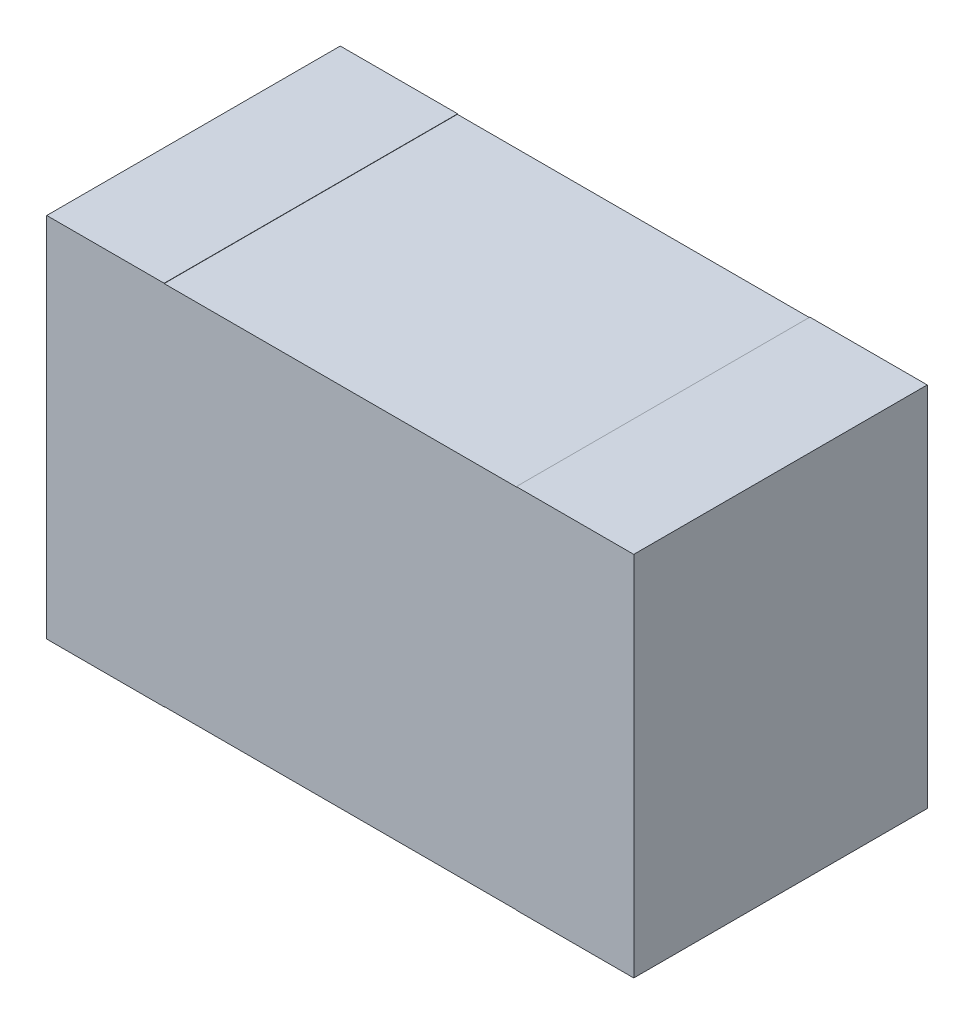
ISO-10303-21;
HEADER;
FILE_DESCRIPTION(('STEP AP214'),'2;1');
FILE_NAME('part.step','',(''),(''),'','','');
FILE_SCHEMA(('AUTOMOTIVE_DESIGN { 1 0 10303 214 1 1 1 1 }'));
ENDSEC;
DATA;
#1=APPLICATION_CONTEXT('core data for automotive mechanical design processes');
#2=APPLICATION_PROTOCOL_DEFINITION('international standard','automotive_design',2000,#1);
#3=PRODUCT_CONTEXT('',#1,'mechanical');
#4=PRODUCT('Part','Part','',(#3));
#5=PRODUCT_RELATED_PRODUCT_CATEGORY('part','',(#4));
#6=PRODUCT_DEFINITION_FORMATION('','',#4);
#7=PRODUCT_DEFINITION_CONTEXT('part definition',#1,'design');
#8=PRODUCT_DEFINITION('design','',#6,#7);
#9=PRODUCT_DEFINITION_SHAPE('','',#8);
#10=(LENGTH_UNIT() NAMED_UNIT(*) SI_UNIT(.MILLI.,.METRE.));
#11=(NAMED_UNIT(*) PLANE_ANGLE_UNIT() SI_UNIT($,.RADIAN.));
#12=(NAMED_UNIT(*) SI_UNIT($,.STERADIAN.) SOLID_ANGLE_UNIT());
#13=UNCERTAINTY_MEASURE_WITH_UNIT(LENGTH_MEASURE(1.E-05),#10,'distance_accuracy_value','');
#14=(GEOMETRIC_REPRESENTATION_CONTEXT(3) GLOBAL_UNCERTAINTY_ASSIGNED_CONTEXT((#13)) GLOBAL_UNIT_ASSIGNED_CONTEXT((#10,
#11,#12)) REPRESENTATION_CONTEXT('',''));
#15=CARTESIAN_POINT('',(0.,0.,0.));
#16=DIRECTION('',(0.,0.,1.));
#17=DIRECTION('',(1.,0.,0.));
#18=AXIS2_PLACEMENT_3D('',#15,#16,#17);
#19=CARTESIAN_POINT('',(0.6,-0.625,-0.999));
#20=DIRECTION('',(0.,0.,1.));
#21=DIRECTION('',(0.,-1.,0.));
#22=AXIS2_PLACEMENT_3D('',#19,#20,#21);
#23=PLANE('',#22);
#24=DIRECTION('',(0.,1.,0.));
#25=VECTOR('',#24,1.);
#26=CARTESIAN_POINT('',(0.6,-0.625,-0.999));
#27=LINE('',#26,#25);
#28=CARTESIAN_POINT('',(0.6,-0.624,-0.999));
#29=VERTEX_POINT('',#28);
#30=CARTESIAN_POINT('',(0.6,0.624,-0.999));
#31=VERTEX_POINT('',#30);
#32=EDGE_CURVE('E187',#29,#31,#27,.T.);
#33=ORIENTED_EDGE('',*,*,#32,.F.);
#34=DIRECTION('',(-1.,0.,0.));
#35=VECTOR('',#34,1.);
#36=CARTESIAN_POINT('',(0.6,-0.624,-0.999));
#37=LINE('',#36,#35);
#38=CARTESIAN_POINT('',(-0.6,-0.624,-0.999));
#39=VERTEX_POINT('',#38);
#40=EDGE_CURVE('E11',#29,#39,#37,.T.);
#41=ORIENTED_EDGE('',*,*,#40,.T.);
#42=DIRECTION('',(0.,1.,0.));
#43=VECTOR('',#42,1.);
#44=CARTESIAN_POINT('',(-0.6,-0.625,-0.999));
#45=LINE('',#44,#43);
#46=CARTESIAN_POINT('',(-0.6,0.624,-0.999));
#47=VERTEX_POINT('',#46);
#48=EDGE_CURVE('E176',#39,#47,#45,.T.);
#49=ORIENTED_EDGE('',*,*,#48,.T.);
#50=DIRECTION('',(-1.,0.,0.));
#51=VECTOR('',#50,1.);
#52=CARTESIAN_POINT('',(0.6,0.624,-0.999));
#53=LINE('',#52,#51);
#54=EDGE_CURVE('E188',#31,#47,#53,.T.);
#55=ORIENTED_EDGE('',*,*,#54,.F.);
#56=EDGE_LOOP('',(#33,#41,#49,#55));
#57=FACE_BOUND('',#56,.T.);
#58=ADVANCED_FACE('F47',(#57),#23,.F.);
#59=CARTESIAN_POINT('',(0.6,-0.624,-1.));
#60=DIRECTION('',(0.,1.,0.));
#61=DIRECTION('',(1.,0.,0.));
#62=AXIS2_PLACEMENT_3D('',#59,#60,#61);
#63=PLANE('',#62);
#64=DIRECTION('',(0.,0.,1.));
#65=VECTOR('',#64,1.);
#66=CARTESIAN_POINT('',(0.6,-0.624,-1.));
#67=LINE('',#66,#65);
#68=CARTESIAN_POINT('',(0.6,-0.624,0.));
#69=VERTEX_POINT('',#68);
#70=EDGE_CURVE('E58',#29,#69,#67,.T.);
#71=ORIENTED_EDGE('',*,*,#70,.T.);
#72=DIRECTION('',(1.,0.,0.));
#73=VECTOR('',#72,1.);
#74=CARTESIAN_POINT('',(0.6,-0.624,0.));
#75=LINE('',#74,#73);
#76=CARTESIAN_POINT('',(-0.6,-0.624,0.));
#77=VERTEX_POINT('',#76);
#78=EDGE_CURVE('E172',#77,#69,#75,.T.);
#79=ORIENTED_EDGE('',*,*,#78,.F.);
#80=DIRECTION('',(0.,0.,1.));
#81=VECTOR('',#80,1.);
#82=CARTESIAN_POINT('',(-0.6,-0.624,-1.));
#83=LINE('',#82,#81);
#84=EDGE_CURVE('E167',#39,#77,#83,.T.);
#85=ORIENTED_EDGE('',*,*,#84,.F.);
#86=ORIENTED_EDGE('',*,*,#40,.F.);
#87=EDGE_LOOP('',(#71,#79,#85,#86));
#88=FACE_BOUND('',#87,.T.);
#89=ADVANCED_FACE('F169',(#88),#63,.F.);
#90=CARTESIAN_POINT('',(0.6,0.625,-1.));
#91=DIRECTION('',(1.,0.,0.));
#92=DIRECTION('',(0.,1.,0.));
#93=AXIS2_PLACEMENT_3D('',#90,#91,#92);
#94=PLANE('',#93);
#95=DIRECTION('',(0.,-1.,0.));
#96=VECTOR('',#95,1.);
#97=CARTESIAN_POINT('',(0.6,0.625,0.));
#98=LINE('',#97,#96);
#99=CARTESIAN_POINT('',(0.6,0.625,0.));
#100=VERTEX_POINT('',#99);
#101=CARTESIAN_POINT('',(0.6,0.624,0.));
#102=VERTEX_POINT('',#101);
#103=EDGE_CURVE('E207',#100,#102,#98,.T.);
#104=ORIENTED_EDGE('',*,*,#103,.F.);
#105=DIRECTION('',(0.,0.,1.));
#106=VECTOR('',#105,1.);
#107=CARTESIAN_POINT('',(0.6,0.625,-1.));
#108=LINE('',#107,#106);
#109=CARTESIAN_POINT('',(0.6,0.625,-1.));
#110=VERTEX_POINT('',#109);
#111=EDGE_CURVE('E270',#110,#100,#108,.T.);
#112=ORIENTED_EDGE('',*,*,#111,.F.);
#113=DIRECTION('',(0.,-1.,0.));
#114=VECTOR('',#113,1.);
#115=CARTESIAN_POINT('',(0.6,0.625,-1.));
#116=LINE('',#115,#114);
#117=CARTESIAN_POINT('',(0.6,-0.625,-1.));
#118=VERTEX_POINT('',#117);
#119=EDGE_CURVE('E201',#110,#118,#116,.T.);
#120=ORIENTED_EDGE('',*,*,#119,.T.);
#121=DIRECTION('',(0.,0.,1.));
#122=VECTOR('',#121,1.);
#123=CARTESIAN_POINT('',(0.6,-0.625,-1.));
#124=LINE('',#123,#122);
#125=CARTESIAN_POINT('',(0.6,-0.625,0.));
#126=VERTEX_POINT('',#125);
#127=EDGE_CURVE('E226',#118,#126,#124,.T.);
#128=ORIENTED_EDGE('',*,*,#127,.T.);
#129=DIRECTION('',(2.168404344971E-13,-1.,0.));
#130=VECTOR('',#129,1.);
#131=CARTESIAN_POINT('',(0.6,-0.624,0.));
#132=LINE('',#131,#130);
#133=EDGE_CURVE('E177',#69,#126,#132,.T.);
#134=ORIENTED_EDGE('',*,*,#133,.F.);
#135=ORIENTED_EDGE('',*,*,#70,.F.);
#136=ORIENTED_EDGE('',*,*,#32,.T.);
#137=DIRECTION('',(0.,0.,1.));
#138=VECTOR('',#137,1.);
#139=CARTESIAN_POINT('',(0.6,0.624,-1.));
#140=LINE('',#139,#138);
#141=EDGE_CURVE('E190',#31,#102,#140,.T.);
#142=ORIENTED_EDGE('',*,*,#141,.T.);
#143=EDGE_LOOP('',(#104,#112,#120,#128,#134,#135,#136,#142));
#144=FACE_BOUND('',#143,.T.);
#145=ADVANCED_FACE('F318',(#144),#94,.F.);
#146=CARTESIAN_POINT('',(0.6,0.624,-1.));
#147=DIRECTION('',(0.,-1.,0.));
#148=DIRECTION('',(0.,0.,1.));
#149=AXIS2_PLACEMENT_3D('',#146,#147,#148);
#150=PLANE('',#149);
#151=DIRECTION('',(0.,0.,1.));
#152=VECTOR('',#151,1.);
#153=CARTESIAN_POINT('',(-0.6,0.624,-1.));
#154=LINE('',#153,#152);
#155=CARTESIAN_POINT('',(-0.6,0.624,0.));
#156=VERTEX_POINT('',#155);
#157=EDGE_CURVE('E181',#47,#156,#154,.T.);
#158=ORIENTED_EDGE('',*,*,#157,.T.);
#159=DIRECTION('',(-1.,0.,0.));
#160=VECTOR('',#159,1.);
#161=CARTESIAN_POINT('',(0.6,0.624,0.));
#162=LINE('',#161,#160);
#163=EDGE_CURVE('E159',#102,#156,#162,.T.);
#164=ORIENTED_EDGE('',*,*,#163,.F.);
#165=ORIENTED_EDGE('',*,*,#141,.F.);
#166=ORIENTED_EDGE('',*,*,#54,.T.);
#167=EDGE_LOOP('',(#158,#164,#165,#166));
#168=FACE_BOUND('',#167,.T.);
#169=ADVANCED_FACE('F316',(#168),#150,.F.);
#170=CARTESIAN_POINT('',(-0.6,0.625,-1.));
#171=DIRECTION('',(-1.,0.,0.));
#172=DIRECTION('',(0.,0.,-1.));
#173=AXIS2_PLACEMENT_3D('',#170,#171,#172);
#174=PLANE('',#173);
#175=DIRECTION('',(0.,1.,0.));
#176=VECTOR('',#175,1.);
#177=CARTESIAN_POINT('',(-0.6,0.625,0.));
#178=LINE('',#177,#176);
#179=CARTESIAN_POINT('',(-0.6,0.625,0.));
#180=VERTEX_POINT('',#179);
#181=EDGE_CURVE('E208',#156,#180,#178,.T.);
#182=ORIENTED_EDGE('',*,*,#181,.F.);
#183=ORIENTED_EDGE('',*,*,#157,.F.);
#184=ORIENTED_EDGE('',*,*,#48,.F.);
#185=ORIENTED_EDGE('',*,*,#84,.T.);
#186=DIRECTION('',(-2.168404344971E-13,1.,0.));
#187=VECTOR('',#186,1.);
#188=CARTESIAN_POINT('',(-0.6,-0.624,0.));
#189=LINE('',#188,#187);
#190=CARTESIAN_POINT('',(-0.6,-0.625,0.));
#191=VERTEX_POINT('',#190);
#192=EDGE_CURVE('E219',#191,#77,#189,.T.);
#193=ORIENTED_EDGE('',*,*,#192,.F.);
#194=DIRECTION('',(0.,0.,1.));
#195=VECTOR('',#194,1.);
#196=CARTESIAN_POINT('',(-0.6,-0.625,-1.));
#197=LINE('',#196,#195);
#198=CARTESIAN_POINT('',(-0.6,-0.625,-1.));
#199=VERTEX_POINT('',#198);
#200=EDGE_CURVE('E210',#199,#191,#197,.T.);
#201=ORIENTED_EDGE('',*,*,#200,.F.);
#202=DIRECTION('',(0.,1.,0.));
#203=VECTOR('',#202,1.);
#204=CARTESIAN_POINT('',(-0.6,0.625,-1.));
#205=LINE('',#204,#203);
#206=CARTESIAN_POINT('',(-0.6,0.625,-1.));
#207=VERTEX_POINT('',#206);
#208=EDGE_CURVE('E236',#199,#207,#205,.T.);
#209=ORIENTED_EDGE('',*,*,#208,.T.);
#210=DIRECTION('',(0.,0.,1.));
#211=VECTOR('',#210,1.);
#212=CARTESIAN_POINT('',(-0.6,0.625,-1.));
#213=LINE('',#212,#211);
#214=EDGE_CURVE('E257',#207,#180,#213,.T.);
#215=ORIENTED_EDGE('',*,*,#214,.T.);
#216=EDGE_LOOP('',(#182,#183,#184,#185,#193,#201,#209,#215));
#217=FACE_BOUND('',#216,.T.);
#218=ADVANCED_FACE('F180',(#217),#174,.F.);
#219=CARTESIAN_POINT('',(0.,0.,0.));
#220=DIRECTION('',(0.,0.,-1.));
#221=DIRECTION('',(1.,0.,0.));
#222=AXIS2_PLACEMENT_3D('',#219,#220,#221);
#223=PLANE('',#222);
#224=ORIENTED_EDGE('',*,*,#78,.T.);
#225=ORIENTED_EDGE('',*,*,#133,.T.);
#226=DIRECTION('',(1.,0.,0.));
#227=VECTOR('',#226,1.);
#228=CARTESIAN_POINT('',(-1.,-0.625,0.));
#229=LINE('',#228,#227);
#230=CARTESIAN_POINT('',(1.,-0.625,0.));
#231=VERTEX_POINT('',#230);
#232=EDGE_CURVE('E205',#126,#231,#229,.T.);
#233=ORIENTED_EDGE('',*,*,#232,.T.);
#234=DIRECTION('',(0.,1.,0.));
#235=VECTOR('',#234,1.);
#236=CARTESIAN_POINT('',(1.,0.625,0.));
#237=LINE('',#236,#235);
#238=CARTESIAN_POINT('',(1.,0.625,0.));
#239=VERTEX_POINT('',#238);
#240=EDGE_CURVE('E231',#231,#239,#237,.T.);
#241=ORIENTED_EDGE('',*,*,#240,.T.);
#242=DIRECTION('',(-1.,0.,0.));
#243=VECTOR('',#242,1.);
#244=CARTESIAN_POINT('',(-1.,0.625,0.));
#245=LINE('',#244,#243);
#246=EDGE_CURVE('E277',#239,#100,#245,.T.);
#247=ORIENTED_EDGE('',*,*,#246,.T.);
#248=ORIENTED_EDGE('',*,*,#103,.T.);
#249=ORIENTED_EDGE('',*,*,#163,.T.);
#250=ORIENTED_EDGE('',*,*,#181,.T.);
#251=DIRECTION('',(-1.,0.,0.));
#252=VECTOR('',#251,1.);
#253=CARTESIAN_POINT('',(-1.,0.625,0.));
#254=LINE('',#253,#252);
#255=CARTESIAN_POINT('',(-1.,0.625,0.));
#256=VERTEX_POINT('',#255);
#257=EDGE_CURVE('E200',#180,#256,#254,.T.);
#258=ORIENTED_EDGE('',*,*,#257,.T.);
#259=DIRECTION('',(0.,-1.,0.));
#260=VECTOR('',#259,1.);
#261=CARTESIAN_POINT('',(-1.,0.625,0.));
#262=LINE('',#261,#260);
#263=CARTESIAN_POINT('',(-1.,-0.625,0.));
#264=VERTEX_POINT('',#263);
#265=EDGE_CURVE('E227',#256,#264,#262,.T.);
#266=ORIENTED_EDGE('',*,*,#265,.T.);
#267=DIRECTION('',(1.,0.,0.));
#268=VECTOR('',#267,1.);
#269=CARTESIAN_POINT('',(-1.,-0.625,0.));
#270=LINE('',#269,#268);
#271=EDGE_CURVE('E215',#264,#191,#270,.T.);
#272=ORIENTED_EDGE('',*,*,#271,.T.);
#273=ORIENTED_EDGE('',*,*,#192,.T.);
#274=EDGE_LOOP('',(#224,#225,#233,#241,#247,#248,#249,#250,#258,#266,#272,#273));
#275=FACE_BOUND('',#274,.T.);
#276=ADVANCED_FACE('F320',(#275),#223,.F.);
#277=CARTESIAN_POINT('',(0.,0.,-1.));
#278=DIRECTION('',(0.,0.,-1.));
#279=DIRECTION('',(1.,0.,0.));
#280=AXIS2_PLACEMENT_3D('',#277,#278,#279);
#281=PLANE('',#280);
#282=ORIENTED_EDGE('',*,*,#119,.F.);
#283=DIRECTION('',(-1.,0.,0.));
#284=VECTOR('',#283,1.);
#285=CARTESIAN_POINT('',(-1.,0.625,-1.));
#286=LINE('',#285,#284);
#287=CARTESIAN_POINT('',(1.,0.625,-1.));
#288=VERTEX_POINT('',#287);
#289=EDGE_CURVE('E267',#288,#110,#286,.T.);
#290=ORIENTED_EDGE('',*,*,#289,.F.);
#291=DIRECTION('',(0.,1.,0.));
#292=VECTOR('',#291,1.);
#293=CARTESIAN_POINT('',(1.,0.625,-1.));
#294=LINE('',#293,#292);
#295=CARTESIAN_POINT('',(1.,-0.625,-1.));
#296=VERTEX_POINT('',#295);
#297=EDGE_CURVE('E230',#296,#288,#294,.T.);
#298=ORIENTED_EDGE('',*,*,#297,.F.);
#299=DIRECTION('',(1.,0.,0.));
#300=VECTOR('',#299,1.);
#301=CARTESIAN_POINT('',(-1.,-0.625,-1.));
#302=LINE('',#301,#300);
#303=EDGE_CURVE('E222',#118,#296,#302,.T.);
#304=ORIENTED_EDGE('',*,*,#303,.F.);
#305=EDGE_LOOP('',(#282,#290,#298,#304));
#306=FACE_BOUND('',#305,.T.);
#307=ADVANCED_FACE('F450',(#306),#281,.T.);
#308=CARTESIAN_POINT('',(-1.,-0.625,-1.));
#309=DIRECTION('',(0.,1.,0.));
#310=DIRECTION('',(1.,0.,0.));
#311=AXIS2_PLACEMENT_3D('',#308,#309,#310);
#312=PLANE('',#311);
#313=ORIENTED_EDGE('',*,*,#303,.T.);
#314=DIRECTION('',(0.,0.,1.));
#315=VECTOR('',#314,1.);
#316=CARTESIAN_POINT('',(1.,-0.625,-1.));
#317=LINE('',#316,#315);
#318=EDGE_CURVE('E51',#296,#231,#317,.T.);
#319=ORIENTED_EDGE('',*,*,#318,.T.);
#320=ORIENTED_EDGE('',*,*,#232,.F.);
#321=ORIENTED_EDGE('',*,*,#127,.F.);
#322=EDGE_LOOP('',(#313,#319,#320,#321));
#323=FACE_BOUND('',#322,.T.);
#324=ADVANCED_FACE('F457',(#323),#312,.F.);
#325=CARTESIAN_POINT('',(-1.,0.625,-1.));
#326=DIRECTION('',(1.,0.,0.));
#327=DIRECTION('',(0.,1.,0.));
#328=AXIS2_PLACEMENT_3D('',#325,#326,#327);
#329=PLANE('',#328);
#330=ORIENTED_EDGE('',*,*,#265,.F.);
#331=DIRECTION('',(0.,0.,1.));
#332=VECTOR('',#331,1.);
#333=CARTESIAN_POINT('',(-1.,0.625,-1.));
#334=LINE('',#333,#332);
#335=CARTESIAN_POINT('',(-1.,0.625,-1.));
#336=VERTEX_POINT('',#335);
#337=EDGE_CURVE('E276',#336,#256,#334,.T.);
#338=ORIENTED_EDGE('',*,*,#337,.F.);
#339=DIRECTION('',(0.,-1.,0.));
#340=VECTOR('',#339,1.);
#341=CARTESIAN_POINT('',(-1.,0.625,-1.));
#342=LINE('',#341,#340);
#343=CARTESIAN_POINT('',(-1.,-0.625,-1.));
#344=VERTEX_POINT('',#343);
#345=EDGE_CURVE('E235',#336,#344,#342,.T.);
#346=ORIENTED_EDGE('',*,*,#345,.T.);
#347=DIRECTION('',(0.,0.,1.));
#348=VECTOR('',#347,1.);
#349=CARTESIAN_POINT('',(-1.,-0.625,-1.));
#350=LINE('',#349,#348);
#351=EDGE_CURVE('E214',#344,#264,#350,.T.);
#352=ORIENTED_EDGE('',*,*,#351,.T.);
#353=EDGE_LOOP('',(#330,#338,#346,#352));
#354=FACE_BOUND('',#353,.T.);
#355=ADVANCED_FACE('F49',(#354),#329,.F.);
#356=CARTESIAN_POINT('',(-1.,0.625,-1.));
#357=DIRECTION('',(0.,-1.,0.));
#358=DIRECTION('',(0.,0.,1.));
#359=AXIS2_PLACEMENT_3D('',#356,#357,#358);
#360=PLANE('',#359);
#361=ORIENTED_EDGE('',*,*,#246,.F.);
#362=DIRECTION('',(0.,0.,1.));
#363=VECTOR('',#362,1.);
#364=CARTESIAN_POINT('',(1.,0.625,-1.));
#365=LINE('',#364,#363);
#366=EDGE_CURVE('E228',#288,#239,#365,.T.);
#367=ORIENTED_EDGE('',*,*,#366,.F.);
#368=ORIENTED_EDGE('',*,*,#289,.T.);
#369=ORIENTED_EDGE('',*,*,#111,.T.);
#370=EDGE_LOOP('',(#361,#367,#368,#369));
#371=FACE_BOUND('',#370,.T.);
#372=ADVANCED_FACE('F373',(#371),#360,.F.);
#373=CARTESIAN_POINT('',(1.,0.625,-1.));
#374=DIRECTION('',(-1.,0.,0.));
#375=DIRECTION('',(0.,0.,-1.));
#376=AXIS2_PLACEMENT_3D('',#373,#374,#375);
#377=PLANE('',#376);
#378=ORIENTED_EDGE('',*,*,#240,.F.);
#379=ORIENTED_EDGE('',*,*,#318,.F.);
#380=ORIENTED_EDGE('',*,*,#297,.T.);
#381=ORIENTED_EDGE('',*,*,#366,.T.);
#382=EDGE_LOOP('',(#378,#379,#380,#381));
#383=FACE_BOUND('',#382,.T.);
#384=ADVANCED_FACE('F379',(#383),#377,.F.);
#385=CARTESIAN_POINT('',(-1.,0.625,-1.));
#386=DIRECTION('',(0.,-1.,0.));
#387=DIRECTION('',(0.,0.,1.));
#388=AXIS2_PLACEMENT_3D('',#385,#386,#387);
#389=PLANE('',#388);
#390=DIRECTION('',(-1.,0.,0.));
#391=VECTOR('',#390,1.);
#392=CARTESIAN_POINT('',(-1.,0.625,-1.));
#393=LINE('',#392,#391);
#394=EDGE_CURVE('E233',#207,#336,#393,.T.);
#395=ORIENTED_EDGE('',*,*,#394,.T.);
#396=ORIENTED_EDGE('',*,*,#337,.T.);
#397=ORIENTED_EDGE('',*,*,#257,.F.);
#398=ORIENTED_EDGE('',*,*,#214,.F.);
#399=EDGE_LOOP('',(#395,#396,#397,#398));
#400=FACE_BOUND('',#399,.T.);
#401=ADVANCED_FACE('F326',(#400),#389,.F.);
#402=CARTESIAN_POINT('',(-1.,-0.625,-1.));
#403=DIRECTION('',(0.,1.,0.));
#404=DIRECTION('',(1.,0.,0.));
#405=AXIS2_PLACEMENT_3D('',#402,#403,#404);
#406=PLANE('',#405);
#407=ORIENTED_EDGE('',*,*,#271,.F.);
#408=ORIENTED_EDGE('',*,*,#351,.F.);
#409=DIRECTION('',(1.,0.,0.));
#410=VECTOR('',#409,1.);
#411=CARTESIAN_POINT('',(-1.,-0.625,-1.));
#412=LINE('',#411,#410);
#413=EDGE_CURVE('E266',#344,#199,#412,.T.);
#414=ORIENTED_EDGE('',*,*,#413,.T.);
#415=ORIENTED_EDGE('',*,*,#200,.T.);
#416=EDGE_LOOP('',(#407,#408,#414,#415));
#417=FACE_BOUND('',#416,.T.);
#418=ADVANCED_FACE('F431',(#417),#406,.F.);
#419=CARTESIAN_POINT('',(0.,0.,-1.));
#420=DIRECTION('',(0.,0.,-1.));
#421=DIRECTION('',(1.,0.,0.));
#422=AXIS2_PLACEMENT_3D('',#419,#420,#421);
#423=PLANE('',#422);
#424=ORIENTED_EDGE('',*,*,#413,.F.);
#425=ORIENTED_EDGE('',*,*,#345,.F.);
#426=ORIENTED_EDGE('',*,*,#394,.F.);
#427=ORIENTED_EDGE('',*,*,#208,.F.);
#428=EDGE_LOOP('',(#424,#425,#426,#427));
#429=FACE_BOUND('',#428,.T.);
#430=ADVANCED_FACE('F426',(#429),#423,.T.);
#431=CLOSED_SHELL('',(#58,#89,#145,#169,#218,#276,#307,#324,#355,#372,#384,#401,#418,#430));
#432=MANIFOLD_SOLID_BREP('B2',#431);
#433=ADVANCED_BREP_SHAPE_REPRESENTATION('',(#18,#432),#14);
#434=SHAPE_DEFINITION_REPRESENTATION(#9,#433);
ENDSEC;
END-ISO-10303-21;
